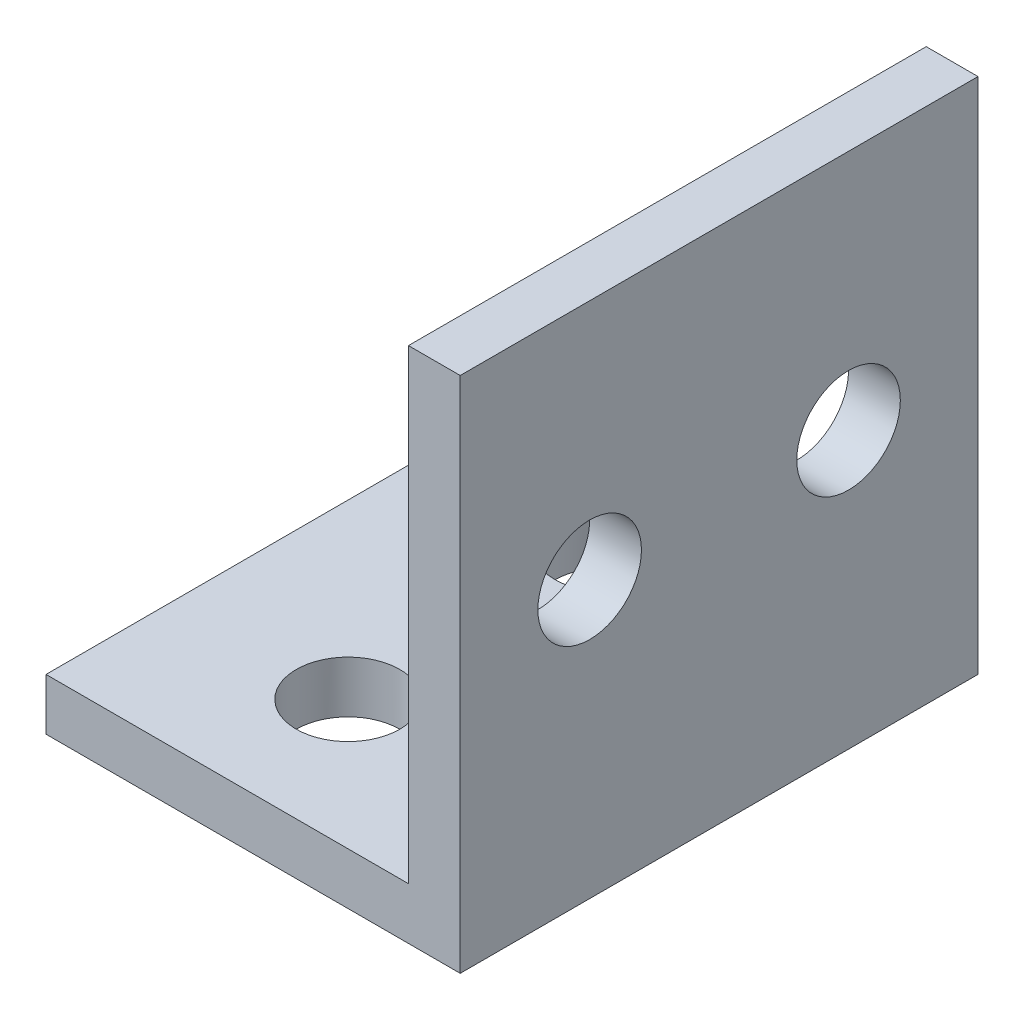
ISO-10303-21;
HEADER;
FILE_DESCRIPTION(('STEP AP214'),'2;1');
FILE_NAME('part.step','',(''),(''),'','','');
FILE_SCHEMA(('AUTOMOTIVE_DESIGN { 1 0 10303 214 1 1 1 1 }'));
ENDSEC;
DATA;
#1=APPLICATION_CONTEXT('core data for automotive mechanical design processes');
#2=APPLICATION_PROTOCOL_DEFINITION('international standard','automotive_design',2000,#1);
#3=PRODUCT_CONTEXT('',#1,'mechanical');
#4=PRODUCT('Part','Part','',(#3));
#5=PRODUCT_RELATED_PRODUCT_CATEGORY('part','',(#4));
#6=PRODUCT_DEFINITION_FORMATION('','',#4);
#7=PRODUCT_DEFINITION_CONTEXT('part definition',#1,'design');
#8=PRODUCT_DEFINITION('design','',#6,#7);
#9=PRODUCT_DEFINITION_SHAPE('','',#8);
#10=(LENGTH_UNIT() NAMED_UNIT(*) SI_UNIT(.MILLI.,.METRE.));
#11=(NAMED_UNIT(*) PLANE_ANGLE_UNIT() SI_UNIT($,.RADIAN.));
#12=(NAMED_UNIT(*) SI_UNIT($,.STERADIAN.) SOLID_ANGLE_UNIT());
#13=UNCERTAINTY_MEASURE_WITH_UNIT(LENGTH_MEASURE(1.E-05),#10,'distance_accuracy_value','');
#14=(GEOMETRIC_REPRESENTATION_CONTEXT(3) GLOBAL_UNCERTAINTY_ASSIGNED_CONTEXT((#13)) GLOBAL_UNIT_ASSIGNED_CONTEXT((#10,
#11,#12)) REPRESENTATION_CONTEXT('',''));
#15=CARTESIAN_POINT('',(0.,0.,0.));
#16=DIRECTION('',(0.,0.,1.));
#17=DIRECTION('',(1.,0.,0.));
#18=AXIS2_PLACEMENT_3D('',#15,#16,#17);
#19=CARTESIAN_POINT('',(-14.,51.,15.));
#20=DIRECTION('',(1.,0.,0.));
#21=DIRECTION('',(0.,1.,0.));
#22=AXIS2_PLACEMENT_3D('',#19,#20,#21);
#23=PLANE('',#22);
#24=CARTESIAN_POINT('',(-14.,37.,-7.5));
#25=DIRECTION('',(1.,0.,0.));
#26=DIRECTION('',(0.,1.,0.));
#27=AXIS2_PLACEMENT_3D('',#24,#25,#26);
#28=CIRCLE('',#27,3.);
#29=CARTESIAN_POINT('',(-14.,40.,-7.5));
#30=VERTEX_POINT('',#29);
#31=EDGE_CURVE('E172',#30,#30,#28,.F.);
#32=ORIENTED_EDGE('',*,*,#31,.F.);
#33=EDGE_LOOP('',(#32));
#34=FACE_BOUND('',#33,.T.);
#35=CARTESIAN_POINT('',(-14.,37.,7.5));
#36=DIRECTION('',(1.,0.,0.));
#37=DIRECTION('',(0.,1.,0.));
#38=AXIS2_PLACEMENT_3D('',#35,#36,#37);
#39=CIRCLE('',#38,3.);
#40=CARTESIAN_POINT('',(-14.,40.,7.5));
#41=VERTEX_POINT('',#40);
#42=EDGE_CURVE('E126',#41,#41,#39,.F.);
#43=ORIENTED_EDGE('',*,*,#42,.F.);
#44=EDGE_LOOP('',(#43));
#45=FACE_BOUND('',#44,.T.);
#46=DIRECTION('',(0.,0.,-1.));
#47=VECTOR('',#46,1.);
#48=CARTESIAN_POINT('',(-14.,51.,15.));
#49=LINE('',#48,#47);
#50=CARTESIAN_POINT('',(-14.,51.,15.));
#51=VERTEX_POINT('',#50);
#52=CARTESIAN_POINT('',(-14.,51.,-15.));
#53=VERTEX_POINT('',#52);
#54=EDGE_CURVE('E117',#51,#53,#49,.T.);
#55=ORIENTED_EDGE('',*,*,#54,.T.);
#56=DIRECTION('',(0.,-1.,0.));
#57=VECTOR('',#56,1.);
#58=CARTESIAN_POINT('',(-14.,51.,-15.));
#59=LINE('',#58,#57);
#60=CARTESIAN_POINT('',(-14.,24.,-15.));
#61=VERTEX_POINT('',#60);
#62=EDGE_CURVE('E110',#53,#61,#59,.T.);
#63=ORIENTED_EDGE('',*,*,#62,.T.);
#64=DIRECTION('',(0.,0.,-1.));
#65=VECTOR('',#64,1.);
#66=CARTESIAN_POINT('',(-14.,24.,15.));
#67=LINE('',#66,#65);
#68=CARTESIAN_POINT('',(-14.,24.,15.));
#69=VERTEX_POINT('',#68);
#70=EDGE_CURVE('E11',#69,#61,#67,.T.);
#71=ORIENTED_EDGE('',*,*,#70,.F.);
#72=DIRECTION('',(0.,-1.,0.));
#73=VECTOR('',#72,1.);
#74=CARTESIAN_POINT('',(-14.,51.,15.));
#75=LINE('',#74,#73);
#76=EDGE_CURVE('E142',#51,#69,#75,.T.);
#77=ORIENTED_EDGE('',*,*,#76,.F.);
#78=EDGE_LOOP('',(#55,#63,#71,#77));
#79=FACE_BOUND('',#78,.T.);
#80=ADVANCED_FACE('F43',(#34,#45,#79),#23,.F.);
#81=CARTESIAN_POINT('',(-14.,24.,15.));
#82=DIRECTION('',(0.,-1.,0.));
#83=DIRECTION('',(1.,0.,0.));
#84=AXIS2_PLACEMENT_3D('',#81,#82,#83);
#85=PLANE('',#84);
#86=CARTESIAN_POINT('',(-25.,24.,-7.5));
#87=DIRECTION('',(0.,-1.,0.));
#88=DIRECTION('',(1.,0.,0.));
#89=AXIS2_PLACEMENT_3D('',#86,#87,#88);
#90=CIRCLE('',#89,3.);
#91=CARTESIAN_POINT('',(-22.,24.,-7.5));
#92=VERTEX_POINT('',#91);
#93=EDGE_CURVE('E176',#92,#92,#90,.T.);
#94=ORIENTED_EDGE('',*,*,#93,.T.);
#95=EDGE_LOOP('',(#94));
#96=FACE_BOUND('',#95,.T.);
#97=CARTESIAN_POINT('',(-25.,24.,7.5));
#98=DIRECTION('',(0.,-1.,0.));
#99=DIRECTION('',(1.,0.,0.));
#100=AXIS2_PLACEMENT_3D('',#97,#98,#99);
#101=CIRCLE('',#100,3.);
#102=CARTESIAN_POINT('',(-22.,24.,7.5));
#103=VERTEX_POINT('',#102);
#104=EDGE_CURVE('E183',#103,#103,#101,.T.);
#105=ORIENTED_EDGE('',*,*,#104,.T.);
#106=EDGE_LOOP('',(#105));
#107=FACE_BOUND('',#106,.T.);
#108=ORIENTED_EDGE('',*,*,#70,.T.);
#109=DIRECTION('',(-1.,0.,0.));
#110=VECTOR('',#109,1.);
#111=CARTESIAN_POINT('',(-14.,24.,-15.));
#112=LINE('',#111,#110);
#113=CARTESIAN_POINT('',(-35.,24.,-15.));
#114=VERTEX_POINT('',#113);
#115=EDGE_CURVE('E100',#61,#114,#112,.T.);
#116=ORIENTED_EDGE('',*,*,#115,.T.);
#117=DIRECTION('',(0.,0.,-1.));
#118=VECTOR('',#117,1.);
#119=CARTESIAN_POINT('',(-35.,24.,15.));
#120=LINE('',#119,#118);
#121=CARTESIAN_POINT('',(-35.,24.,15.));
#122=VERTEX_POINT('',#121);
#123=EDGE_CURVE('E52',#122,#114,#120,.T.);
#124=ORIENTED_EDGE('',*,*,#123,.F.);
#125=DIRECTION('',(-1.,0.,0.));
#126=VECTOR('',#125,1.);
#127=CARTESIAN_POINT('',(-14.,24.,15.));
#128=LINE('',#127,#126);
#129=EDGE_CURVE('E101',#69,#122,#128,.T.);
#130=ORIENTED_EDGE('',*,*,#129,.F.);
#131=EDGE_LOOP('',(#108,#116,#124,#130));
#132=FACE_BOUND('',#131,.T.);
#133=ADVANCED_FACE('F98',(#96,#107,#132),#85,.F.);
#134=CARTESIAN_POINT('',(-35.,24.,15.));
#135=DIRECTION('',(1.,0.,0.));
#136=DIRECTION('',(0.,0.,-1.));
#137=AXIS2_PLACEMENT_3D('',#134,#135,#136);
#138=PLANE('',#137);
#139=ORIENTED_EDGE('',*,*,#123,.T.);
#140=DIRECTION('',(0.,-1.,0.));
#141=VECTOR('',#140,1.);
#142=CARTESIAN_POINT('',(-35.,24.,-15.));
#143=LINE('',#142,#141);
#144=CARTESIAN_POINT('',(-35.,21.,-15.));
#145=VERTEX_POINT('',#144);
#146=EDGE_CURVE('E114',#114,#145,#143,.T.);
#147=ORIENTED_EDGE('',*,*,#146,.T.);
#148=DIRECTION('',(0.,0.,-1.));
#149=VECTOR('',#148,1.);
#150=CARTESIAN_POINT('',(-35.,21.,15.));
#151=LINE('',#150,#149);
#152=CARTESIAN_POINT('',(-35.,21.,15.));
#153=VERTEX_POINT('',#152);
#154=EDGE_CURVE('E165',#153,#145,#151,.T.);
#155=ORIENTED_EDGE('',*,*,#154,.F.);
#156=DIRECTION('',(0.,-1.,0.));
#157=VECTOR('',#156,1.);
#158=CARTESIAN_POINT('',(-35.,24.,15.));
#159=LINE('',#158,#157);
#160=EDGE_CURVE('E147',#122,#153,#159,.T.);
#161=ORIENTED_EDGE('',*,*,#160,.F.);
#162=EDGE_LOOP('',(#139,#147,#155,#161));
#163=FACE_BOUND('',#162,.T.);
#164=ADVANCED_FACE('F208',(#163),#138,.F.);
#165=CARTESIAN_POINT('',(-35.,21.,15.));
#166=DIRECTION('',(0.,1.,0.));
#167=DIRECTION('',(-1.,0.,0.));
#168=AXIS2_PLACEMENT_3D('',#165,#166,#167);
#169=PLANE('',#168);
#170=CARTESIAN_POINT('',(-25.,21.,-7.5));
#171=DIRECTION('',(0.,1.,0.));
#172=DIRECTION('',(-1.,0.,0.));
#173=AXIS2_PLACEMENT_3D('',#170,#171,#172);
#174=CIRCLE('',#173,3.);
#175=CARTESIAN_POINT('',(-28.,21.,-7.5));
#176=VERTEX_POINT('',#175);
#177=EDGE_CURVE('E46',#176,#176,#174,.F.);
#178=ORIENTED_EDGE('',*,*,#177,.F.);
#179=EDGE_LOOP('',(#178));
#180=FACE_BOUND('',#179,.T.);
#181=CARTESIAN_POINT('',(-25.,21.,7.5));
#182=DIRECTION('',(0.,1.,0.));
#183=DIRECTION('',(-1.,0.,0.));
#184=AXIS2_PLACEMENT_3D('',#181,#182,#183);
#185=CIRCLE('',#184,3.);
#186=CARTESIAN_POINT('',(-28.,21.,7.5));
#187=VERTEX_POINT('',#186);
#188=EDGE_CURVE('E173',#187,#187,#185,.F.);
#189=ORIENTED_EDGE('',*,*,#188,.F.);
#190=EDGE_LOOP('',(#189));
#191=FACE_BOUND('',#190,.T.);
#192=ORIENTED_EDGE('',*,*,#154,.T.);
#193=DIRECTION('',(1.,0.,0.));
#194=VECTOR('',#193,1.);
#195=CARTESIAN_POINT('',(-35.,21.,-15.));
#196=LINE('',#195,#194);
#197=CARTESIAN_POINT('',(-11.,21.,-15.));
#198=VERTEX_POINT('',#197);
#199=EDGE_CURVE('E131',#145,#198,#196,.T.);
#200=ORIENTED_EDGE('',*,*,#199,.T.);
#201=DIRECTION('',(0.,0.,-1.));
#202=VECTOR('',#201,1.);
#203=CARTESIAN_POINT('',(-11.,21.,15.));
#204=LINE('',#203,#202);
#205=CARTESIAN_POINT('',(-11.,21.,15.));
#206=VERTEX_POINT('',#205);
#207=EDGE_CURVE('E162',#206,#198,#204,.T.);
#208=ORIENTED_EDGE('',*,*,#207,.F.);
#209=DIRECTION('',(1.,0.,0.));
#210=VECTOR('',#209,1.);
#211=CARTESIAN_POINT('',(-35.,21.,15.));
#212=LINE('',#211,#210);
#213=EDGE_CURVE('E150',#153,#206,#212,.T.);
#214=ORIENTED_EDGE('',*,*,#213,.F.);
#215=EDGE_LOOP('',(#192,#200,#208,#214));
#216=FACE_BOUND('',#215,.T.);
#217=ADVANCED_FACE('F214',(#180,#191,#216),#169,.F.);
#218=CARTESIAN_POINT('',(-11.,21.,15.));
#219=DIRECTION('',(-1.,0.,0.));
#220=DIRECTION('',(0.,-1.,0.));
#221=AXIS2_PLACEMENT_3D('',#218,#219,#220);
#222=PLANE('',#221);
#223=CARTESIAN_POINT('',(-11.,37.,-7.5));
#224=DIRECTION('',(-1.,0.,0.));
#225=DIRECTION('',(0.,-1.,0.));
#226=AXIS2_PLACEMENT_3D('',#223,#224,#225);
#227=CIRCLE('',#226,3.);
#228=CARTESIAN_POINT('',(-11.,34.,-7.5));
#229=VERTEX_POINT('',#228);
#230=EDGE_CURVE('E119',#229,#229,#227,.T.);
#231=ORIENTED_EDGE('',*,*,#230,.T.);
#232=EDGE_LOOP('',(#231));
#233=FACE_BOUND('',#232,.T.);
#234=CARTESIAN_POINT('',(-11.,37.,7.5));
#235=DIRECTION('',(-1.,0.,0.));
#236=DIRECTION('',(0.,-1.,0.));
#237=AXIS2_PLACEMENT_3D('',#234,#235,#236);
#238=CIRCLE('',#237,3.);
#239=CARTESIAN_POINT('',(-11.,34.,7.5));
#240=VERTEX_POINT('',#239);
#241=EDGE_CURVE('E123',#240,#240,#238,.T.);
#242=ORIENTED_EDGE('',*,*,#241,.T.);
#243=EDGE_LOOP('',(#242));
#244=FACE_BOUND('',#243,.T.);
#245=ORIENTED_EDGE('',*,*,#207,.T.);
#246=DIRECTION('',(0.,1.,0.));
#247=VECTOR('',#246,1.);
#248=CARTESIAN_POINT('',(-11.,21.,-15.));
#249=LINE('',#248,#247);
#250=CARTESIAN_POINT('',(-11.,51.,-15.));
#251=VERTEX_POINT('',#250);
#252=EDGE_CURVE('E135',#198,#251,#249,.T.);
#253=ORIENTED_EDGE('',*,*,#252,.T.);
#254=DIRECTION('',(0.,0.,-1.));
#255=VECTOR('',#254,1.);
#256=CARTESIAN_POINT('',(-11.,51.,15.));
#257=LINE('',#256,#255);
#258=CARTESIAN_POINT('',(-11.,51.,15.));
#259=VERTEX_POINT('',#258);
#260=EDGE_CURVE('E159',#259,#251,#257,.T.);
#261=ORIENTED_EDGE('',*,*,#260,.F.);
#262=DIRECTION('',(0.,1.,0.));
#263=VECTOR('',#262,1.);
#264=CARTESIAN_POINT('',(-11.,21.,15.));
#265=LINE('',#264,#263);
#266=EDGE_CURVE('E65',#206,#259,#265,.T.);
#267=ORIENTED_EDGE('',*,*,#266,.F.);
#268=EDGE_LOOP('',(#245,#253,#261,#267));
#269=FACE_BOUND('',#268,.T.);
#270=ADVANCED_FACE('F220',(#233,#244,#269),#222,.F.);
#271=CARTESIAN_POINT('',(-11.,51.,15.));
#272=DIRECTION('',(0.,-1.,0.));
#273=DIRECTION('',(0.,0.,-1.));
#274=AXIS2_PLACEMENT_3D('',#271,#272,#273);
#275=PLANE('',#274);
#276=ORIENTED_EDGE('',*,*,#260,.T.);
#277=DIRECTION('',(-1.,0.,0.));
#278=VECTOR('',#277,1.);
#279=CARTESIAN_POINT('',(-11.,51.,-15.));
#280=LINE('',#279,#278);
#281=EDGE_CURVE('E139',#251,#53,#280,.T.);
#282=ORIENTED_EDGE('',*,*,#281,.T.);
#283=ORIENTED_EDGE('',*,*,#54,.F.);
#284=DIRECTION('',(-1.,0.,0.));
#285=VECTOR('',#284,1.);
#286=CARTESIAN_POINT('',(-11.,51.,15.));
#287=LINE('',#286,#285);
#288=EDGE_CURVE('E60',#259,#51,#287,.T.);
#289=ORIENTED_EDGE('',*,*,#288,.F.);
#290=EDGE_LOOP('',(#276,#282,#283,#289));
#291=FACE_BOUND('',#290,.T.);
#292=ADVANCED_FACE('F223',(#291),#275,.F.);
#293=CARTESIAN_POINT('',(0.,0.,15.));
#294=DIRECTION('',(0.,0.,-1.));
#295=DIRECTION('',(-1.,0.,0.));
#296=AXIS2_PLACEMENT_3D('',#293,#294,#295);
#297=PLANE('',#296);
#298=ORIENTED_EDGE('',*,*,#76,.T.);
#299=ORIENTED_EDGE('',*,*,#129,.T.);
#300=ORIENTED_EDGE('',*,*,#160,.T.);
#301=ORIENTED_EDGE('',*,*,#213,.T.);
#302=ORIENTED_EDGE('',*,*,#266,.T.);
#303=ORIENTED_EDGE('',*,*,#288,.T.);
#304=EDGE_LOOP('',(#298,#299,#300,#301,#302,#303));
#305=FACE_BOUND('',#304,.T.);
#306=ADVANCED_FACE('F227',(#305),#297,.F.);
#307=CARTESIAN_POINT('',(0.,0.,-15.));
#308=DIRECTION('',(0.,0.,-1.));
#309=DIRECTION('',(-1.,0.,0.));
#310=AXIS2_PLACEMENT_3D('',#307,#308,#309);
#311=PLANE('',#310);
#312=ORIENTED_EDGE('',*,*,#62,.F.);
#313=ORIENTED_EDGE('',*,*,#281,.F.);
#314=ORIENTED_EDGE('',*,*,#252,.F.);
#315=ORIENTED_EDGE('',*,*,#199,.F.);
#316=ORIENTED_EDGE('',*,*,#146,.F.);
#317=ORIENTED_EDGE('',*,*,#115,.F.);
#318=EDGE_LOOP('',(#312,#313,#314,#315,#316,#317));
#319=FACE_BOUND('',#318,.T.);
#320=ADVANCED_FACE('F108',(#319),#311,.T.);
#321=CARTESIAN_POINT('',(-22.4852813742386,37.,7.5));
#322=DIRECTION('',(1.,0.,0.));
#323=DIRECTION('',(0.,0.,-1.));
#324=AXIS2_PLACEMENT_3D('',#321,#322,#323);
#325=CYLINDRICAL_SURFACE('',#324,3.);
#326=ORIENTED_EDGE('',*,*,#42,.T.);
#327=EDGE_LOOP('',(#326));
#328=FACE_BOUND('',#327,.T.);
#329=ORIENTED_EDGE('',*,*,#241,.F.);
#330=EDGE_LOOP('',(#329));
#331=FACE_BOUND('',#330,.T.);
#332=ADVANCED_FACE('F198',(#328,#331),#325,.F.);
#333=CARTESIAN_POINT('',(-22.4852813742386,37.,-7.5));
#334=DIRECTION('',(1.,0.,0.));
#335=DIRECTION('',(0.,0.,-1.));
#336=AXIS2_PLACEMENT_3D('',#333,#334,#335);
#337=CYLINDRICAL_SURFACE('',#336,3.);
#338=ORIENTED_EDGE('',*,*,#31,.T.);
#339=EDGE_LOOP('',(#338));
#340=FACE_BOUND('',#339,.T.);
#341=ORIENTED_EDGE('',*,*,#230,.F.);
#342=EDGE_LOOP('',(#341));
#343=FACE_BOUND('',#342,.T.);
#344=ADVANCED_FACE('F234',(#340,#343),#337,.F.);
#345=CARTESIAN_POINT('',(-25.,32.4852813742386,7.5));
#346=DIRECTION('',(0.,-1.,0.));
#347=DIRECTION('',(0.,0.,-1.));
#348=AXIS2_PLACEMENT_3D('',#345,#346,#347);
#349=CYLINDRICAL_SURFACE('',#348,3.);
#350=ORIENTED_EDGE('',*,*,#104,.F.);
#351=EDGE_LOOP('',(#350));
#352=FACE_BOUND('',#351,.T.);
#353=ORIENTED_EDGE('',*,*,#188,.T.);
#354=EDGE_LOOP('',(#353));
#355=FACE_BOUND('',#354,.T.);
#356=ADVANCED_FACE('F236',(#352,#355),#349,.F.);
#357=CARTESIAN_POINT('',(-25.,32.4852813742386,-7.5));
#358=DIRECTION('',(0.,-1.,0.));
#359=DIRECTION('',(0.,0.,-1.));
#360=AXIS2_PLACEMENT_3D('',#357,#358,#359);
#361=CYLINDRICAL_SURFACE('',#360,3.);
#362=ORIENTED_EDGE('',*,*,#93,.F.);
#363=EDGE_LOOP('',(#362));
#364=FACE_BOUND('',#363,.T.);
#365=ORIENTED_EDGE('',*,*,#177,.T.);
#366=EDGE_LOOP('',(#365));
#367=FACE_BOUND('',#366,.T.);
#368=ADVANCED_FACE('F239',(#364,#367),#361,.F.);
#369=CLOSED_SHELL('',(#80,#133,#164,#217,#270,#292,#306,#320,#332,#344,#356,#368));
#370=MANIFOLD_SOLID_BREP('B2',#369);
#371=ADVANCED_BREP_SHAPE_REPRESENTATION('',(#18,#370),#14);
#372=SHAPE_DEFINITION_REPRESENTATION(#9,#371);
ENDSEC;
END-ISO-10303-21;
